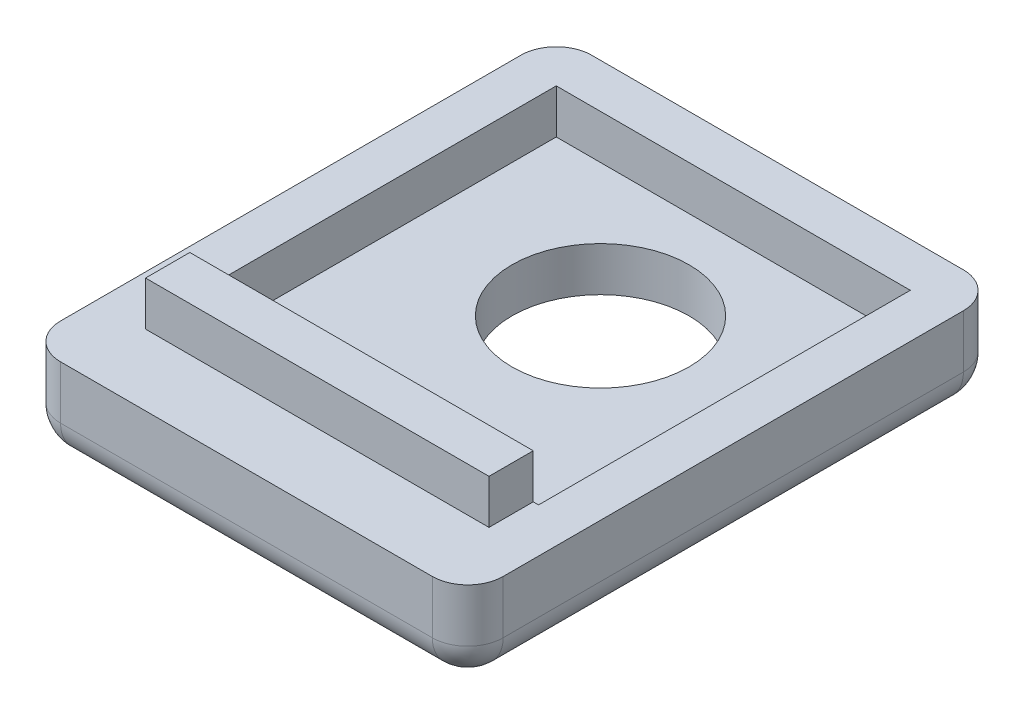
ISO-10303-21;
HEADER;
FILE_DESCRIPTION(('STEP AP214'),'2;1');
FILE_NAME('part.step','',(''),(''),'','','');
FILE_SCHEMA(('AUTOMOTIVE_DESIGN { 1 0 10303 214 1 1 1 1 }'));
ENDSEC;
DATA;
#1=APPLICATION_CONTEXT('core data for automotive mechanical design processes');
#2=APPLICATION_PROTOCOL_DEFINITION('international standard','automotive_design',2000,#1);
#3=PRODUCT_CONTEXT('',#1,'mechanical');
#4=PRODUCT('Part','Part','',(#3));
#5=PRODUCT_RELATED_PRODUCT_CATEGORY('part','',(#4));
#6=PRODUCT_DEFINITION_FORMATION('','',#4);
#7=PRODUCT_DEFINITION_CONTEXT('part definition',#1,'design');
#8=PRODUCT_DEFINITION('design','',#6,#7);
#9=PRODUCT_DEFINITION_SHAPE('','',#8);
#10=(LENGTH_UNIT() NAMED_UNIT(*) SI_UNIT(.MILLI.,.METRE.));
#11=(NAMED_UNIT(*) PLANE_ANGLE_UNIT() SI_UNIT($,.RADIAN.));
#12=(NAMED_UNIT(*) SI_UNIT($,.STERADIAN.) SOLID_ANGLE_UNIT());
#13=UNCERTAINTY_MEASURE_WITH_UNIT(LENGTH_MEASURE(1.E-05),#10,'distance_accuracy_value','');
#14=(GEOMETRIC_REPRESENTATION_CONTEXT(3) GLOBAL_UNCERTAINTY_ASSIGNED_CONTEXT((#13)) GLOBAL_UNIT_ASSIGNED_CONTEXT((#10,
#11,#12)) REPRESENTATION_CONTEXT('',''));
#15=CARTESIAN_POINT('',(0.,0.,0.));
#16=DIRECTION('',(0.,0.,1.));
#17=DIRECTION('',(1.,0.,0.));
#18=AXIS2_PLACEMENT_3D('',#15,#16,#17);
#19=CARTESIAN_POINT('',(12.5,2.5,-15.));
#20=DIRECTION('',(-1.,0.,0.));
#21=DIRECTION('',(0.,0.,1.));
#22=AXIS2_PLACEMENT_3D('',#19,#20,#21);
#23=PLANE('',#22);
#24=DIRECTION('',(0.,0.,-1.));
#25=VECTOR('',#24,1.);
#26=CARTESIAN_POINT('',(12.5,2.,-15.));
#27=LINE('',#26,#25);
#28=CARTESIAN_POINT('',(12.5,2.,13.));
#29=VERTEX_POINT('',#28);
#30=CARTESIAN_POINT('',(12.5,2.,-13.));
#31=VERTEX_POINT('',#30);
#32=EDGE_CURVE('E269',#29,#31,#27,.T.);
#33=ORIENTED_EDGE('',*,*,#32,.T.);
#34=DIRECTION('',(0.,-1.,0.));
#35=VECTOR('',#34,1.);
#36=CARTESIAN_POINT('',(12.5,2.5,-13.));
#37=LINE('',#36,#35);
#38=CARTESIAN_POINT('',(12.5,5.,-13.));
#39=VERTEX_POINT('',#38);
#40=EDGE_CURVE('E271',#31,#39,#37,.F.);
#41=ORIENTED_EDGE('',*,*,#40,.T.);
#42=DIRECTION('',(0.,0.,-1.));
#43=VECTOR('',#42,1.);
#44=CARTESIAN_POINT('',(12.5,5.,-15.));
#45=LINE('',#44,#43);
#46=CARTESIAN_POINT('',(12.5,5.,13.));
#47=VERTEX_POINT('',#46);
#48=EDGE_CURVE('E231',#47,#39,#45,.T.);
#49=ORIENTED_EDGE('',*,*,#48,.F.);
#50=DIRECTION('',(0.,-1.,0.));
#51=VECTOR('',#50,1.);
#52=CARTESIAN_POINT('',(12.5,2.5,13.));
#53=LINE('',#52,#51);
#54=EDGE_CURVE('E267',#47,#29,#53,.T.);
#55=ORIENTED_EDGE('',*,*,#54,.T.);
#56=EDGE_LOOP('',(#33,#41,#49,#55));
#57=FACE_BOUND('',#56,.T.);
#58=ADVANCED_FACE('F33',(#57),#23,.F.);
#59=CARTESIAN_POINT('',(-12.5,2.5,-15.));
#60=DIRECTION('',(0.,0.,1.));
#61=DIRECTION('',(1.,0.,0.));
#62=AXIS2_PLACEMENT_3D('',#59,#60,#61);
#63=PLANE('',#62);
#64=DIRECTION('',(-1.,0.,0.));
#65=VECTOR('',#64,1.);
#66=CARTESIAN_POINT('',(-12.5,2.,-15.));
#67=LINE('',#66,#65);
#68=CARTESIAN_POINT('',(10.5,2.,-15.));
#69=VERTEX_POINT('',#68);
#70=CARTESIAN_POINT('',(-10.5,2.,-15.));
#71=VERTEX_POINT('',#70);
#72=EDGE_CURVE('E239',#69,#71,#67,.T.);
#73=ORIENTED_EDGE('',*,*,#72,.T.);
#74=DIRECTION('',(0.,-1.,0.));
#75=VECTOR('',#74,1.);
#76=CARTESIAN_POINT('',(-10.5,2.5,-15.));
#77=LINE('',#76,#75);
#78=CARTESIAN_POINT('',(-10.5,5.,-15.));
#79=VERTEX_POINT('',#78);
#80=EDGE_CURVE('E242',#71,#79,#77,.F.);
#81=ORIENTED_EDGE('',*,*,#80,.T.);
#82=DIRECTION('',(-1.,0.,0.));
#83=VECTOR('',#82,1.);
#84=CARTESIAN_POINT('',(-12.5,5.,-15.));
#85=LINE('',#84,#83);
#86=CARTESIAN_POINT('',(10.5,5.,-15.));
#87=VERTEX_POINT('',#86);
#88=EDGE_CURVE('E234',#87,#79,#85,.T.);
#89=ORIENTED_EDGE('',*,*,#88,.F.);
#90=DIRECTION('',(0.,-1.,0.));
#91=VECTOR('',#90,1.);
#92=CARTESIAN_POINT('',(10.5,2.5,-15.));
#93=LINE('',#92,#91);
#94=EDGE_CURVE('E237',#87,#69,#93,.T.);
#95=ORIENTED_EDGE('',*,*,#94,.T.);
#96=EDGE_LOOP('',(#73,#81,#89,#95));
#97=FACE_BOUND('',#96,.T.);
#98=ADVANCED_FACE('F331',(#97),#63,.F.);
#99=CARTESIAN_POINT('',(-12.5,2.5,-15.));
#100=DIRECTION('',(1.,0.,0.));
#101=DIRECTION('',(0.,0.,-1.));
#102=AXIS2_PLACEMENT_3D('',#99,#100,#101);
#103=PLANE('',#102);
#104=DIRECTION('',(0.,0.,1.));
#105=VECTOR('',#104,1.);
#106=CARTESIAN_POINT('',(-12.5,5.,-15.));
#107=LINE('',#106,#105);
#108=CARTESIAN_POINT('',(-12.5,5.,-13.));
#109=VERTEX_POINT('',#108);
#110=CARTESIAN_POINT('',(-12.5,5.,13.));
#111=VERTEX_POINT('',#110);
#112=EDGE_CURVE('E225',#109,#111,#107,.T.);
#113=ORIENTED_EDGE('',*,*,#112,.F.);
#114=DIRECTION('',(0.,-1.,0.));
#115=VECTOR('',#114,1.);
#116=CARTESIAN_POINT('',(-12.5,2.5,-13.));
#117=LINE('',#116,#115);
#118=CARTESIAN_POINT('',(-12.5,2.,-13.));
#119=VERTEX_POINT('',#118);
#120=EDGE_CURVE('E257',#109,#119,#117,.T.);
#121=ORIENTED_EDGE('',*,*,#120,.T.);
#122=DIRECTION('',(0.,0.,1.));
#123=VECTOR('',#122,1.);
#124=CARTESIAN_POINT('',(-12.5,2.,-15.));
#125=LINE('',#124,#123);
#126=CARTESIAN_POINT('',(-12.5,2.,13.));
#127=VERTEX_POINT('',#126);
#128=EDGE_CURVE('E255',#119,#127,#125,.T.);
#129=ORIENTED_EDGE('',*,*,#128,.T.);
#130=DIRECTION('',(0.,-1.,0.));
#131=VECTOR('',#130,1.);
#132=CARTESIAN_POINT('',(-12.5,2.5,13.));
#133=LINE('',#132,#131);
#134=EDGE_CURVE('E253',#127,#111,#133,.F.);
#135=ORIENTED_EDGE('',*,*,#134,.T.);
#136=EDGE_LOOP('',(#113,#121,#129,#135));
#137=FACE_BOUND('',#136,.T.);
#138=ADVANCED_FACE('F341',(#137),#103,.F.);
#139=CARTESIAN_POINT('',(-12.5,2.5,15.));
#140=DIRECTION('',(0.,0.,-1.));
#141=DIRECTION('',(-1.,0.,0.));
#142=AXIS2_PLACEMENT_3D('',#139,#140,#141);
#143=PLANE('',#142);
#144=DIRECTION('',(1.,0.,0.));
#145=VECTOR('',#144,1.);
#146=CARTESIAN_POINT('',(-12.5,2.,15.));
#147=LINE('',#146,#145);
#148=CARTESIAN_POINT('',(-10.5,2.,15.));
#149=VERTEX_POINT('',#148);
#150=CARTESIAN_POINT('',(10.5,2.,15.));
#151=VERTEX_POINT('',#150);
#152=EDGE_CURVE('E42',#149,#151,#147,.T.);
#153=ORIENTED_EDGE('',*,*,#152,.T.);
#154=DIRECTION('',(0.,-1.,0.));
#155=VECTOR('',#154,1.);
#156=CARTESIAN_POINT('',(10.5,2.5,15.));
#157=LINE('',#156,#155);
#158=CARTESIAN_POINT('',(10.5,5.,15.));
#159=VERTEX_POINT('',#158);
#160=EDGE_CURVE('E11',#151,#159,#157,.F.);
#161=ORIENTED_EDGE('',*,*,#160,.T.);
#162=DIRECTION('',(1.,0.,0.));
#163=VECTOR('',#162,1.);
#164=CARTESIAN_POINT('',(-12.5,5.,15.));
#165=LINE('',#164,#163);
#166=CARTESIAN_POINT('',(-10.5,5.,15.));
#167=VERTEX_POINT('',#166);
#168=EDGE_CURVE('E228',#167,#159,#165,.T.);
#169=ORIENTED_EDGE('',*,*,#168,.F.);
#170=DIRECTION('',(0.,-1.,0.));
#171=VECTOR('',#170,1.);
#172=CARTESIAN_POINT('',(-10.5,2.5,15.));
#173=LINE('',#172,#171);
#174=EDGE_CURVE('E273',#167,#149,#173,.T.);
#175=ORIENTED_EDGE('',*,*,#174,.T.);
#176=EDGE_LOOP('',(#153,#161,#169,#175));
#177=FACE_BOUND('',#176,.T.);
#178=ADVANCED_FACE('F363',(#177),#143,.F.);
#179=CARTESIAN_POINT('',(0.,0.,0.));
#180=DIRECTION('',(0.,1.,0.));
#181=DIRECTION('',(0.,0.,1.));
#182=AXIS2_PLACEMENT_3D('',#179,#180,#181);
#183=PLANE('',#182);
#184=DIRECTION('',(0.,0.,1.));
#185=VECTOR('',#184,1.);
#186=CARTESIAN_POINT('',(-10.5,0.,0.));
#187=LINE('',#186,#185);
#188=CARTESIAN_POINT('',(-10.5,0.,13.));
#189=VERTEX_POINT('',#188);
#190=CARTESIAN_POINT('',(-10.5,0.,-13.));
#191=VERTEX_POINT('',#190);
#192=EDGE_CURVE('E248',#189,#191,#187,.F.);
#193=ORIENTED_EDGE('',*,*,#192,.T.);
#194=DIRECTION('',(-1.,0.,0.));
#195=VECTOR('',#194,1.);
#196=CARTESIAN_POINT('',(0.,0.,-13.));
#197=LINE('',#196,#195);
#198=CARTESIAN_POINT('',(10.5,0.,-13.));
#199=VERTEX_POINT('',#198);
#200=EDGE_CURVE('E250',#191,#199,#197,.F.);
#201=ORIENTED_EDGE('',*,*,#200,.T.);
#202=DIRECTION('',(0.,0.,-1.));
#203=VECTOR('',#202,1.);
#204=CARTESIAN_POINT('',(10.5,0.,0.));
#205=LINE('',#204,#203);
#206=CARTESIAN_POINT('',(10.5,0.,13.));
#207=VERTEX_POINT('',#206);
#208=EDGE_CURVE('E246',#199,#207,#205,.F.);
#209=ORIENTED_EDGE('',*,*,#208,.T.);
#210=DIRECTION('',(1.,0.,0.));
#211=VECTOR('',#210,1.);
#212=CARTESIAN_POINT('',(0.,0.,13.));
#213=LINE('',#212,#211);
#214=EDGE_CURVE('E244',#207,#189,#213,.F.);
#215=ORIENTED_EDGE('',*,*,#214,.T.);
#216=EDGE_LOOP('',(#193,#201,#209,#215));
#217=FACE_BOUND('',#216,.T.);
#218=CARTESIAN_POINT('',(0.,0.,-5.));
#219=DIRECTION('',(0.,1.,0.));
#220=DIRECTION('',(0.,0.,1.));
#221=AXIS2_PLACEMENT_3D('',#218,#219,#220);
#222=CIRCLE('',#221,5.);
#223=CARTESIAN_POINT('',(0.,0.,0.));
#224=VERTEX_POINT('',#223);
#225=EDGE_CURVE('E189',#224,#224,#222,.T.);
#226=ORIENTED_EDGE('',*,*,#225,.T.);
#227=EDGE_LOOP('',(#226));
#228=FACE_BOUND('',#227,.T.);
#229=ADVANCED_FACE('F358',(#217,#228),#183,.F.);
#230=CARTESIAN_POINT('',(0.,5.,0.));
#231=DIRECTION('',(0.,1.,0.));
#232=DIRECTION('',(0.,0.,1.));
#233=AXIS2_PLACEMENT_3D('',#230,#231,#232);
#234=PLANE('',#233);
#235=DIRECTION('',(0.,0.,1.));
#236=VECTOR('',#235,1.);
#237=CARTESIAN_POINT('',(-9.7,5.,8.5));
#238=LINE('',#237,#236);
#239=CARTESIAN_POINT('',(-9.7,5.,8.5));
#240=VERTEX_POINT('',#239);
#241=CARTESIAN_POINT('',(-9.7,5.,11.));
#242=VERTEX_POINT('',#241);
#243=EDGE_CURVE('E180',#240,#242,#238,.T.);
#244=ORIENTED_EDGE('',*,*,#243,.F.);
#245=DIRECTION('',(1.,0.,0.));
#246=VECTOR('',#245,1.);
#247=CARTESIAN_POINT('',(-10.,5.,8.5));
#248=LINE('',#247,#246);
#249=CARTESIAN_POINT('',(-10.,5.,8.5));
#250=VERTEX_POINT('',#249);
#251=EDGE_CURVE('E199',#250,#240,#248,.T.);
#252=ORIENTED_EDGE('',*,*,#251,.F.);
#253=DIRECTION('',(0.,0.,1.));
#254=VECTOR('',#253,1.);
#255=CARTESIAN_POINT('',(-10.,5.,-12.5));
#256=LINE('',#255,#254);
#257=CARTESIAN_POINT('',(-10.,5.,-12.5));
#258=VERTEX_POINT('',#257);
#259=EDGE_CURVE('E196',#258,#250,#256,.T.);
#260=ORIENTED_EDGE('',*,*,#259,.F.);
#261=DIRECTION('',(-1.,0.,0.));
#262=VECTOR('',#261,1.);
#263=CARTESIAN_POINT('',(-10.,5.,-12.5));
#264=LINE('',#263,#262);
#265=CARTESIAN_POINT('',(10.,5.,-12.5));
#266=VERTEX_POINT('',#265);
#267=EDGE_CURVE('E205',#266,#258,#264,.T.);
#268=ORIENTED_EDGE('',*,*,#267,.F.);
#269=DIRECTION('',(0.,0.,-1.));
#270=VECTOR('',#269,1.);
#271=CARTESIAN_POINT('',(10.,5.,-12.5));
#272=LINE('',#271,#270);
#273=CARTESIAN_POINT('',(10.,5.,8.5));
#274=VERTEX_POINT('',#273);
#275=EDGE_CURVE('E202',#274,#266,#272,.T.);
#276=ORIENTED_EDGE('',*,*,#275,.F.);
#277=CARTESIAN_POINT('',(9.70000000000001,5.,8.5));
#278=VERTEX_POINT('',#277);
#279=EDGE_CURVE('E56',#278,#274,#248,.T.);
#280=ORIENTED_EDGE('',*,*,#279,.F.);
#281=DIRECTION('',(0.,0.,-1.));
#282=VECTOR('',#281,1.);
#283=CARTESIAN_POINT('',(9.70000000000001,5.,8.5));
#284=LINE('',#283,#282);
#285=CARTESIAN_POINT('',(9.70000000000001,5.,11.));
#286=VERTEX_POINT('',#285);
#287=EDGE_CURVE('E177',#286,#278,#284,.T.);
#288=ORIENTED_EDGE('',*,*,#287,.F.);
#289=DIRECTION('',(1.,0.,0.));
#290=VECTOR('',#289,1.);
#291=CARTESIAN_POINT('',(-9.7,5.,11.));
#292=LINE('',#291,#290);
#293=EDGE_CURVE('E50',#242,#286,#292,.T.);
#294=ORIENTED_EDGE('',*,*,#293,.F.);
#295=EDGE_LOOP('',(#244,#252,#260,#268,#276,#280,#288,#294));
#296=FACE_BOUND('',#295,.T.);
#297=ORIENTED_EDGE('',*,*,#88,.T.);
#298=CARTESIAN_POINT('',(-10.5,5.,-13.));
#299=DIRECTION('',(0.,1.,0.));
#300=DIRECTION('',(0.,0.,1.));
#301=AXIS2_PLACEMENT_3D('',#298,#299,#300);
#302=CIRCLE('',#301,2.);
#303=EDGE_CURVE('E265',#79,#109,#302,.T.);
#304=ORIENTED_EDGE('',*,*,#303,.T.);
#305=ORIENTED_EDGE('',*,*,#112,.T.);
#306=CARTESIAN_POINT('',(-10.5,5.,13.));
#307=DIRECTION('',(0.,1.,0.));
#308=DIRECTION('',(0.,0.,1.));
#309=AXIS2_PLACEMENT_3D('',#306,#307,#308);
#310=CIRCLE('',#309,2.);
#311=EDGE_CURVE('E259',#111,#167,#310,.T.);
#312=ORIENTED_EDGE('',*,*,#311,.T.);
#313=ORIENTED_EDGE('',*,*,#168,.T.);
#314=CARTESIAN_POINT('',(10.5,5.,13.));
#315=DIRECTION('',(0.,1.,0.));
#316=DIRECTION('',(0.,0.,1.));
#317=AXIS2_PLACEMENT_3D('',#314,#315,#316);
#318=CIRCLE('',#317,2.);
#319=EDGE_CURVE('E261',#159,#47,#318,.T.);
#320=ORIENTED_EDGE('',*,*,#319,.T.);
#321=ORIENTED_EDGE('',*,*,#48,.T.);
#322=CARTESIAN_POINT('',(10.5,5.,-13.));
#323=DIRECTION('',(0.,1.,0.));
#324=DIRECTION('',(0.,0.,1.));
#325=AXIS2_PLACEMENT_3D('',#322,#323,#324);
#326=CIRCLE('',#325,2.);
#327=EDGE_CURVE('E263',#39,#87,#326,.T.);
#328=ORIENTED_EDGE('',*,*,#327,.T.);
#329=EDGE_LOOP('',(#297,#304,#305,#312,#313,#320,#321,#328));
#330=FACE_BOUND('',#329,.T.);
#331=ADVANCED_FACE('F328',(#296,#330),#234,.T.);
#332=CARTESIAN_POINT('',(-10.,5.,-12.5));
#333=DIRECTION('',(1.,0.,0.));
#334=DIRECTION('',(0.,0.,-1.));
#335=AXIS2_PLACEMENT_3D('',#332,#333,#334);
#336=PLANE('',#335);
#337=DIRECTION('',(0.,0.,1.));
#338=VECTOR('',#337,1.);
#339=CARTESIAN_POINT('',(-10.,2.5,-12.5));
#340=LINE('',#339,#338);
#341=CARTESIAN_POINT('',(-10.,2.5,-12.5));
#342=VERTEX_POINT('',#341);
#343=CARTESIAN_POINT('',(-10.,2.5,8.5));
#344=VERTEX_POINT('',#343);
#345=EDGE_CURVE('E192',#342,#344,#340,.T.);
#346=ORIENTED_EDGE('',*,*,#345,.F.);
#347=DIRECTION('',(0.,-1.,0.));
#348=VECTOR('',#347,1.);
#349=CARTESIAN_POINT('',(-10.,5.,-12.5));
#350=LINE('',#349,#348);
#351=EDGE_CURVE('E207',#258,#342,#350,.T.);
#352=ORIENTED_EDGE('',*,*,#351,.F.);
#353=ORIENTED_EDGE('',*,*,#259,.T.);
#354=DIRECTION('',(0.,-1.,0.));
#355=VECTOR('',#354,1.);
#356=CARTESIAN_POINT('',(-10.,5.,8.5));
#357=LINE('',#356,#355);
#358=EDGE_CURVE('E222',#250,#344,#357,.T.);
#359=ORIENTED_EDGE('',*,*,#358,.T.);
#360=EDGE_LOOP('',(#346,#352,#353,#359));
#361=FACE_BOUND('',#360,.T.);
#362=ADVANCED_FACE('F494',(#361),#336,.T.);
#363=CARTESIAN_POINT('',(-10.,5.,8.5));
#364=DIRECTION('',(0.,0.,-1.));
#365=DIRECTION('',(-1.,0.,0.));
#366=AXIS2_PLACEMENT_3D('',#363,#364,#365);
#367=PLANE('',#366);
#368=DIRECTION('',(1.,0.,0.));
#369=VECTOR('',#368,1.);
#370=CARTESIAN_POINT('',(-10.,2.5,8.5));
#371=LINE('',#370,#369);
#372=CARTESIAN_POINT('',(10.,2.5,8.5));
#373=VERTEX_POINT('',#372);
#374=EDGE_CURVE('E209',#344,#373,#371,.T.);
#375=ORIENTED_EDGE('',*,*,#374,.F.);
#376=ORIENTED_EDGE('',*,*,#358,.F.);
#377=ORIENTED_EDGE('',*,*,#251,.T.);
#378=DIRECTION('',(0.,-1.,0.));
#379=VECTOR('',#378,1.);
#380=CARTESIAN_POINT('',(-9.7,7.5,8.5));
#381=LINE('',#380,#379);
#382=CARTESIAN_POINT('',(-9.7,7.5,8.5));
#383=VERTEX_POINT('',#382);
#384=EDGE_CURVE('E636',#383,#240,#381,.T.);
#385=ORIENTED_EDGE('',*,*,#384,.F.);
#386=DIRECTION('',(-1.,0.,0.));
#387=VECTOR('',#386,1.);
#388=CARTESIAN_POINT('',(-9.7,7.5,8.5));
#389=LINE('',#388,#387);
#390=CARTESIAN_POINT('',(9.70000000000001,7.5,8.5));
#391=VERTEX_POINT('',#390);
#392=EDGE_CURVE('E173',#391,#383,#389,.T.);
#393=ORIENTED_EDGE('',*,*,#392,.F.);
#394=DIRECTION('',(0.,-1.,0.));
#395=VECTOR('',#394,1.);
#396=CARTESIAN_POINT('',(9.70000000000001,7.5,8.5));
#397=LINE('',#396,#395);
#398=EDGE_CURVE('E185',#391,#278,#397,.T.);
#399=ORIENTED_EDGE('',*,*,#398,.T.);
#400=ORIENTED_EDGE('',*,*,#279,.T.);
#401=DIRECTION('',(0.,-1.,0.));
#402=VECTOR('',#401,1.);
#403=CARTESIAN_POINT('',(10.,5.,8.5));
#404=LINE('',#403,#402);
#405=EDGE_CURVE('E219',#274,#373,#404,.T.);
#406=ORIENTED_EDGE('',*,*,#405,.T.);
#407=EDGE_LOOP('',(#375,#376,#377,#385,#393,#399,#400,#406));
#408=FACE_BOUND('',#407,.T.);
#409=ADVANCED_FACE('F488',(#408),#367,.T.);
#410=CARTESIAN_POINT('',(10.,5.,-12.5));
#411=DIRECTION('',(-1.,0.,0.));
#412=DIRECTION('',(0.,0.,1.));
#413=AXIS2_PLACEMENT_3D('',#410,#411,#412);
#414=PLANE('',#413);
#415=DIRECTION('',(0.,0.,-1.));
#416=VECTOR('',#415,1.);
#417=CARTESIAN_POINT('',(10.,2.5,-12.5));
#418=LINE('',#417,#416);
#419=CARTESIAN_POINT('',(10.,2.5,-12.5));
#420=VERTEX_POINT('',#419);
#421=EDGE_CURVE('E211',#373,#420,#418,.T.);
#422=ORIENTED_EDGE('',*,*,#421,.F.);
#423=ORIENTED_EDGE('',*,*,#405,.F.);
#424=ORIENTED_EDGE('',*,*,#275,.T.);
#425=DIRECTION('',(0.,-1.,0.));
#426=VECTOR('',#425,1.);
#427=CARTESIAN_POINT('',(10.,5.,-12.5));
#428=LINE('',#427,#426);
#429=EDGE_CURVE('E216',#266,#420,#428,.T.);
#430=ORIENTED_EDGE('',*,*,#429,.T.);
#431=EDGE_LOOP('',(#422,#423,#424,#430));
#432=FACE_BOUND('',#431,.T.);
#433=ADVANCED_FACE('F493',(#432),#414,.T.);
#434=CARTESIAN_POINT('',(-10.,5.,-12.5));
#435=DIRECTION('',(0.,0.,1.));
#436=DIRECTION('',(1.,0.,0.));
#437=AXIS2_PLACEMENT_3D('',#434,#435,#436);
#438=PLANE('',#437);
#439=DIRECTION('',(-1.,0.,0.));
#440=VECTOR('',#439,1.);
#441=CARTESIAN_POINT('',(-10.,2.5,-12.5));
#442=LINE('',#441,#440);
#443=EDGE_CURVE('E198',#420,#342,#442,.T.);
#444=ORIENTED_EDGE('',*,*,#443,.F.);
#445=ORIENTED_EDGE('',*,*,#429,.F.);
#446=ORIENTED_EDGE('',*,*,#267,.T.);
#447=ORIENTED_EDGE('',*,*,#351,.T.);
#448=EDGE_LOOP('',(#444,#445,#446,#447));
#449=FACE_BOUND('',#448,.T.);
#450=ADVANCED_FACE('F538',(#449),#438,.T.);
#451=CARTESIAN_POINT('',(0.,2.5,0.));
#452=DIRECTION('',(0.,1.,0.));
#453=DIRECTION('',(0.,0.,1.));
#454=AXIS2_PLACEMENT_3D('',#451,#452,#453);
#455=PLANE('',#454);
#456=CARTESIAN_POINT('',(0.,2.5,-5.));
#457=DIRECTION('',(0.,1.,0.));
#458=DIRECTION('',(0.,0.,1.));
#459=AXIS2_PLACEMENT_3D('',#456,#457,#458);
#460=CIRCLE('',#459,5.);
#461=CARTESIAN_POINT('',(0.,2.5,0.));
#462=VERTEX_POINT('',#461);
#463=EDGE_CURVE('E193',#462,#462,#460,.T.);
#464=ORIENTED_EDGE('',*,*,#463,.F.);
#465=EDGE_LOOP('',(#464));
#466=FACE_BOUND('',#465,.T.);
#467=ORIENTED_EDGE('',*,*,#345,.T.);
#468=ORIENTED_EDGE('',*,*,#374,.T.);
#469=ORIENTED_EDGE('',*,*,#421,.T.);
#470=ORIENTED_EDGE('',*,*,#443,.T.);
#471=EDGE_LOOP('',(#467,#468,#469,#470));
#472=FACE_BOUND('',#471,.T.);
#473=ADVANCED_FACE('F373',(#466,#472),#455,.T.);
#474=CARTESIAN_POINT('',(0.,0.,-5.));
#475=DIRECTION('',(0.,1.,0.));
#476=DIRECTION('',(0.,0.,1.));
#477=AXIS2_PLACEMENT_3D('',#474,#475,#476);
#478=CYLINDRICAL_SURFACE('',#477,5.);
#479=ORIENTED_EDGE('',*,*,#225,.F.);
#480=EDGE_LOOP('',(#479));
#481=FACE_BOUND('',#480,.T.);
#482=ORIENTED_EDGE('',*,*,#463,.T.);
#483=EDGE_LOOP('',(#482));
#484=FACE_BOUND('',#483,.T.);
#485=ADVANCED_FACE('F368',(#481,#484),#478,.F.);
#486=CARTESIAN_POINT('',(10.5,2.5,13.));
#487=DIRECTION('',(0.,-1.,0.));
#488=DIRECTION('',(0.,0.,-1.));
#489=AXIS2_PLACEMENT_3D('',#486,#487,#488);
#490=CYLINDRICAL_SURFACE('',#489,2.);
#491=ORIENTED_EDGE('',*,*,#319,.F.);
#492=ORIENTED_EDGE('',*,*,#160,.F.);
#493=CARTESIAN_POINT('',(10.5,2.,13.));
#494=DIRECTION('',(0.,-1.,0.));
#495=DIRECTION('',(0.,0.,-1.));
#496=AXIS2_PLACEMENT_3D('',#493,#494,#495);
#497=CIRCLE('',#496,2.);
#498=EDGE_CURVE('E300',#29,#151,#497,.T.);
#499=ORIENTED_EDGE('',*,*,#498,.F.);
#500=ORIENTED_EDGE('',*,*,#54,.F.);
#501=EDGE_LOOP('',(#491,#492,#499,#500));
#502=FACE_BOUND('',#501,.T.);
#503=ADVANCED_FACE('F35',(#502),#490,.T.);
#504=CARTESIAN_POINT('',(-10.5,2.5,13.));
#505=DIRECTION('',(0.,-1.,0.));
#506=DIRECTION('',(0.,0.,-1.));
#507=AXIS2_PLACEMENT_3D('',#504,#505,#506);
#508=CYLINDRICAL_SURFACE('',#507,2.);
#509=ORIENTED_EDGE('',*,*,#311,.F.);
#510=ORIENTED_EDGE('',*,*,#134,.F.);
#511=CARTESIAN_POINT('',(-10.5,2.,13.));
#512=DIRECTION('',(0.,-1.,0.));
#513=DIRECTION('',(0.,0.,-1.));
#514=AXIS2_PLACEMENT_3D('',#511,#512,#513);
#515=CIRCLE('',#514,2.);
#516=EDGE_CURVE('E298',#149,#127,#515,.T.);
#517=ORIENTED_EDGE('',*,*,#516,.F.);
#518=ORIENTED_EDGE('',*,*,#174,.F.);
#519=EDGE_LOOP('',(#509,#510,#517,#518));
#520=FACE_BOUND('',#519,.T.);
#521=ADVANCED_FACE('F346',(#520),#508,.T.);
#522=CARTESIAN_POINT('',(-12.5,2.,13.));
#523=DIRECTION('',(1.,0.,0.));
#524=DIRECTION('',(0.,0.,-1.));
#525=AXIS2_PLACEMENT_3D('',#522,#523,#524);
#526=CYLINDRICAL_SURFACE('',#525,2.);
#527=CARTESIAN_POINT('',(10.5,2.,13.));
#528=DIRECTION('',(1.,0.,0.));
#529=DIRECTION('',(0.,0.,-1.));
#530=AXIS2_PLACEMENT_3D('',#527,#528,#529);
#531=CIRCLE('',#530,2.);
#532=EDGE_CURVE('E37',#151,#207,#531,.T.);
#533=ORIENTED_EDGE('',*,*,#532,.F.);
#534=ORIENTED_EDGE('',*,*,#152,.F.);
#535=CARTESIAN_POINT('',(-10.5,2.,13.));
#536=DIRECTION('',(-1.,0.,0.));
#537=DIRECTION('',(0.,0.,1.));
#538=AXIS2_PLACEMENT_3D('',#535,#536,#537);
#539=CIRCLE('',#538,2.);
#540=EDGE_CURVE('E295',#189,#149,#539,.T.);
#541=ORIENTED_EDGE('',*,*,#540,.F.);
#542=ORIENTED_EDGE('',*,*,#214,.F.);
#543=EDGE_LOOP('',(#533,#534,#541,#542));
#544=FACE_BOUND('',#543,.T.);
#545=ADVANCED_FACE('F360',(#544),#526,.T.);
#546=CARTESIAN_POINT('',(10.5,2.,13.));
#547=DIRECTION('',(0.,0.,1.));
#548=DIRECTION('',(1.,0.,0.));
#549=AXIS2_PLACEMENT_3D('',#546,#547,#548);
#550=SPHERICAL_SURFACE('',#549,2.);
#551=ORIENTED_EDGE('',*,*,#498,.T.);
#552=ORIENTED_EDGE('',*,*,#532,.T.);
#553=CARTESIAN_POINT('',(10.5,2.,13.));
#554=DIRECTION('',(0.,0.,1.));
#555=DIRECTION('',(1.,0.,0.));
#556=AXIS2_PLACEMENT_3D('',#553,#554,#555);
#557=CIRCLE('',#556,2.);
#558=EDGE_CURVE('E292',#29,#207,#557,.F.);
#559=ORIENTED_EDGE('',*,*,#558,.F.);
#560=EDGE_LOOP('',(#551,#552,#559));
#561=FACE_BOUND('',#560,.T.);
#562=ADVANCED_FACE('F307',(#561),#550,.T.);
#563=CARTESIAN_POINT('',(-10.5,2.,13.));
#564=DIRECTION('',(0.,0.,1.));
#565=DIRECTION('',(1.,0.,0.));
#566=AXIS2_PLACEMENT_3D('',#563,#564,#565);
#567=SPHERICAL_SURFACE('',#566,2.);
#568=ORIENTED_EDGE('',*,*,#540,.T.);
#569=ORIENTED_EDGE('',*,*,#516,.T.);
#570=CARTESIAN_POINT('',(-10.5,2.,13.));
#571=DIRECTION('',(0.,0.,1.));
#572=DIRECTION('',(1.,0.,0.));
#573=AXIS2_PLACEMENT_3D('',#570,#571,#572);
#574=CIRCLE('',#573,2.);
#575=EDGE_CURVE('E289',#189,#127,#574,.F.);
#576=ORIENTED_EDGE('',*,*,#575,.F.);
#577=EDGE_LOOP('',(#568,#569,#576));
#578=FACE_BOUND('',#577,.T.);
#579=ADVANCED_FACE('F350',(#578),#567,.T.);
#580=CARTESIAN_POINT('',(10.5,2.,-15.));
#581=DIRECTION('',(0.,0.,-1.));
#582=DIRECTION('',(-1.,0.,0.));
#583=AXIS2_PLACEMENT_3D('',#580,#581,#582);
#584=CYLINDRICAL_SURFACE('',#583,2.);
#585=ORIENTED_EDGE('',*,*,#558,.T.);
#586=ORIENTED_EDGE('',*,*,#208,.F.);
#587=CARTESIAN_POINT('',(10.5,2.,-13.));
#588=DIRECTION('',(0.,0.,-1.));
#589=DIRECTION('',(-1.,0.,0.));
#590=AXIS2_PLACEMENT_3D('',#587,#588,#589);
#591=CIRCLE('',#590,2.);
#592=EDGE_CURVE('E286',#31,#199,#591,.T.);
#593=ORIENTED_EDGE('',*,*,#592,.F.);
#594=ORIENTED_EDGE('',*,*,#32,.F.);
#595=EDGE_LOOP('',(#585,#586,#593,#594));
#596=FACE_BOUND('',#595,.T.);
#597=ADVANCED_FACE('F314',(#596),#584,.T.);
#598=CARTESIAN_POINT('',(10.5,2.5,-13.));
#599=DIRECTION('',(0.,-1.,0.));
#600=DIRECTION('',(0.,0.,-1.));
#601=AXIS2_PLACEMENT_3D('',#598,#599,#600);
#602=CYLINDRICAL_SURFACE('',#601,2.);
#603=ORIENTED_EDGE('',*,*,#327,.F.);
#604=ORIENTED_EDGE('',*,*,#40,.F.);
#605=CARTESIAN_POINT('',(10.5,2.,-13.));
#606=DIRECTION('',(0.,-1.,0.));
#607=DIRECTION('',(0.,0.,-1.));
#608=AXIS2_PLACEMENT_3D('',#605,#606,#607);
#609=CIRCLE('',#608,2.);
#610=EDGE_CURVE('E283',#69,#31,#609,.T.);
#611=ORIENTED_EDGE('',*,*,#610,.F.);
#612=ORIENTED_EDGE('',*,*,#94,.F.);
#613=EDGE_LOOP('',(#603,#604,#611,#612));
#614=FACE_BOUND('',#613,.T.);
#615=ADVANCED_FACE('F323',(#614),#602,.T.);
#616=CARTESIAN_POINT('',(-10.5,2.5,-13.));
#617=DIRECTION('',(0.,-1.,0.));
#618=DIRECTION('',(0.,0.,-1.));
#619=AXIS2_PLACEMENT_3D('',#616,#617,#618);
#620=CYLINDRICAL_SURFACE('',#619,2.);
#621=ORIENTED_EDGE('',*,*,#303,.F.);
#622=ORIENTED_EDGE('',*,*,#80,.F.);
#623=CARTESIAN_POINT('',(-10.5,2.,-13.));
#624=DIRECTION('',(0.,-1.,0.));
#625=DIRECTION('',(0.,0.,-1.));
#626=AXIS2_PLACEMENT_3D('',#623,#624,#625);
#627=CIRCLE('',#626,2.);
#628=EDGE_CURVE('E280',#119,#71,#627,.T.);
#629=ORIENTED_EDGE('',*,*,#628,.F.);
#630=ORIENTED_EDGE('',*,*,#120,.F.);
#631=EDGE_LOOP('',(#621,#622,#629,#630));
#632=FACE_BOUND('',#631,.T.);
#633=ADVANCED_FACE('F336',(#632),#620,.T.);
#634=CARTESIAN_POINT('',(-10.5,2.,-15.));
#635=DIRECTION('',(0.,0.,1.));
#636=DIRECTION('',(1.,0.,0.));
#637=AXIS2_PLACEMENT_3D('',#634,#635,#636);
#638=CYLINDRICAL_SURFACE('',#637,2.);
#639=ORIENTED_EDGE('',*,*,#575,.T.);
#640=ORIENTED_EDGE('',*,*,#128,.F.);
#641=CARTESIAN_POINT('',(-10.5,2.,-13.));
#642=DIRECTION('',(0.,0.,-1.));
#643=DIRECTION('',(-1.,0.,0.));
#644=AXIS2_PLACEMENT_3D('',#641,#642,#643);
#645=CIRCLE('',#644,2.);
#646=EDGE_CURVE('E277',#191,#119,#645,.T.);
#647=ORIENTED_EDGE('',*,*,#646,.F.);
#648=ORIENTED_EDGE('',*,*,#192,.F.);
#649=EDGE_LOOP('',(#639,#640,#647,#648));
#650=FACE_BOUND('',#649,.T.);
#651=ADVANCED_FACE('F354',(#650),#638,.T.);
#652=CARTESIAN_POINT('',(10.5,2.,-13.));
#653=DIRECTION('',(1.,0.,0.));
#654=DIRECTION('',(0.,0.,-1.));
#655=AXIS2_PLACEMENT_3D('',#652,#653,#654);
#656=SPHERICAL_SURFACE('',#655,2.);
#657=ORIENTED_EDGE('',*,*,#610,.T.);
#658=ORIENTED_EDGE('',*,*,#592,.T.);
#659=CARTESIAN_POINT('',(10.5,2.,-13.));
#660=DIRECTION('',(1.,0.,0.));
#661=DIRECTION('',(0.,0.,-1.));
#662=AXIS2_PLACEMENT_3D('',#659,#660,#661);
#663=CIRCLE('',#662,2.);
#664=EDGE_CURVE('E183',#69,#199,#663,.F.);
#665=ORIENTED_EDGE('',*,*,#664,.F.);
#666=EDGE_LOOP('',(#657,#658,#665));
#667=FACE_BOUND('',#666,.T.);
#668=ADVANCED_FACE('F391',(#667),#656,.T.);
#669=CARTESIAN_POINT('',(-10.5,2.,-13.));
#670=DIRECTION('',(-1.,0.,0.));
#671=DIRECTION('',(0.,0.,1.));
#672=AXIS2_PLACEMENT_3D('',#669,#670,#671);
#673=SPHERICAL_SURFACE('',#672,2.);
#674=ORIENTED_EDGE('',*,*,#646,.T.);
#675=ORIENTED_EDGE('',*,*,#628,.T.);
#676=CARTESIAN_POINT('',(-10.5,2.,-13.));
#677=DIRECTION('',(-1.,0.,0.));
#678=DIRECTION('',(0.,0.,1.));
#679=AXIS2_PLACEMENT_3D('',#676,#677,#678);
#680=CIRCLE('',#679,2.);
#681=EDGE_CURVE('E181',#191,#71,#680,.F.);
#682=ORIENTED_EDGE('',*,*,#681,.F.);
#683=EDGE_LOOP('',(#674,#675,#682));
#684=FACE_BOUND('',#683,.T.);
#685=ADVANCED_FACE('F387',(#684),#673,.T.);
#686=CARTESIAN_POINT('',(-12.5,2.,-13.));
#687=DIRECTION('',(-1.,0.,0.));
#688=DIRECTION('',(0.,0.,1.));
#689=AXIS2_PLACEMENT_3D('',#686,#687,#688);
#690=CYLINDRICAL_SURFACE('',#689,2.);
#691=ORIENTED_EDGE('',*,*,#664,.T.);
#692=ORIENTED_EDGE('',*,*,#200,.F.);
#693=ORIENTED_EDGE('',*,*,#681,.T.);
#694=ORIENTED_EDGE('',*,*,#72,.F.);
#695=EDGE_LOOP('',(#691,#692,#693,#694));
#696=FACE_BOUND('',#695,.T.);
#697=ADVANCED_FACE('F384',(#696),#690,.T.);
#698=CARTESIAN_POINT('',(-9.7,7.5,8.5));
#699=DIRECTION('',(1.,0.,0.));
#700=DIRECTION('',(0.,0.,-1.));
#701=AXIS2_PLACEMENT_3D('',#698,#699,#700);
#702=PLANE('',#701);
#703=ORIENTED_EDGE('',*,*,#243,.T.);
#704=DIRECTION('',(0.,-1.,0.));
#705=VECTOR('',#704,1.);
#706=CARTESIAN_POINT('',(-9.7,7.5,11.));
#707=LINE('',#706,#705);
#708=CARTESIAN_POINT('',(-9.7,7.5,11.));
#709=VERTEX_POINT('',#708);
#710=EDGE_CURVE('E161',#709,#242,#707,.T.);
#711=ORIENTED_EDGE('',*,*,#710,.F.);
#712=DIRECTION('',(0.,0.,1.));
#713=VECTOR('',#712,1.);
#714=CARTESIAN_POINT('',(-9.7,7.5,8.5));
#715=LINE('',#714,#713);
#716=EDGE_CURVE('E168',#383,#709,#715,.T.);
#717=ORIENTED_EDGE('',*,*,#716,.F.);
#718=ORIENTED_EDGE('',*,*,#384,.T.);
#719=EDGE_LOOP('',(#703,#711,#717,#718));
#720=FACE_BOUND('',#719,.T.);
#721=ADVANCED_FACE('F179',(#720),#702,.F.);
#722=CARTESIAN_POINT('',(-9.7,7.5,11.));
#723=DIRECTION('',(0.,0.,-1.));
#724=DIRECTION('',(-1.,0.,0.));
#725=AXIS2_PLACEMENT_3D('',#722,#723,#724);
#726=PLANE('',#725);
#727=ORIENTED_EDGE('',*,*,#293,.T.);
#728=DIRECTION('',(0.,-1.,0.));
#729=VECTOR('',#728,1.);
#730=CARTESIAN_POINT('',(9.70000000000001,7.5,11.));
#731=LINE('',#730,#729);
#732=CARTESIAN_POINT('',(9.70000000000001,7.5,11.));
#733=VERTEX_POINT('',#732);
#734=EDGE_CURVE('E164',#733,#286,#731,.T.);
#735=ORIENTED_EDGE('',*,*,#734,.F.);
#736=DIRECTION('',(1.,0.,0.));
#737=VECTOR('',#736,1.);
#738=CARTESIAN_POINT('',(-9.7,7.5,11.));
#739=LINE('',#738,#737);
#740=EDGE_CURVE('E157',#709,#733,#739,.T.);
#741=ORIENTED_EDGE('',*,*,#740,.F.);
#742=ORIENTED_EDGE('',*,*,#710,.T.);
#743=EDGE_LOOP('',(#727,#735,#741,#742));
#744=FACE_BOUND('',#743,.T.);
#745=ADVANCED_FACE('F159',(#744),#726,.F.);
#746=CARTESIAN_POINT('',(9.70000000000001,7.5,8.5));
#747=DIRECTION('',(-1.,0.,0.));
#748=DIRECTION('',(0.,0.,1.));
#749=AXIS2_PLACEMENT_3D('',#746,#747,#748);
#750=PLANE('',#749);
#751=ORIENTED_EDGE('',*,*,#287,.T.);
#752=ORIENTED_EDGE('',*,*,#398,.F.);
#753=DIRECTION('',(0.,0.,-1.));
#754=VECTOR('',#753,1.);
#755=CARTESIAN_POINT('',(9.70000000000001,7.5,8.5));
#756=LINE('',#755,#754);
#757=EDGE_CURVE('E167',#733,#391,#756,.T.);
#758=ORIENTED_EDGE('',*,*,#757,.F.);
#759=ORIENTED_EDGE('',*,*,#734,.T.);
#760=EDGE_LOOP('',(#751,#752,#758,#759));
#761=FACE_BOUND('',#760,.T.);
#762=ADVANCED_FACE('F463',(#761),#750,.F.);
#763=CARTESIAN_POINT('',(0.,7.5,0.));
#764=DIRECTION('',(0.,1.,0.));
#765=DIRECTION('',(0.,0.,1.));
#766=AXIS2_PLACEMENT_3D('',#763,#764,#765);
#767=PLANE('',#766);
#768=ORIENTED_EDGE('',*,*,#716,.T.);
#769=ORIENTED_EDGE('',*,*,#740,.T.);
#770=ORIENTED_EDGE('',*,*,#757,.T.);
#771=ORIENTED_EDGE('',*,*,#392,.T.);
#772=EDGE_LOOP('',(#768,#769,#770,#771));
#773=FACE_BOUND('',#772,.T.);
#774=ADVANCED_FACE('F171',(#773),#767,.T.);
#775=CLOSED_SHELL('',(#58,#98,#138,#178,#229,#331,#362,#409,#433,#450,#473,#485,#503,#521,#545,
#562,#579,#597,#615,#633,#651,#668,#685,#697,#721,#745,#762,#774));
#776=MANIFOLD_SOLID_BREP('B2',#775);
#777=ADVANCED_BREP_SHAPE_REPRESENTATION('',(#18,#776),#14);
#778=SHAPE_DEFINITION_REPRESENTATION(#9,#777);
ENDSEC;
END-ISO-10303-21;
